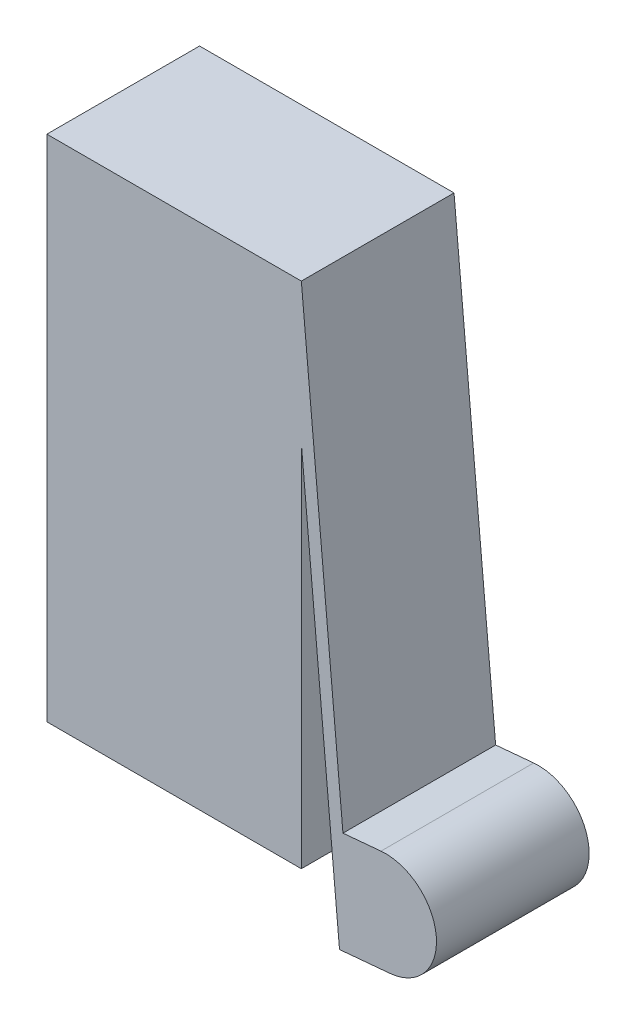
ISO-10303-21;
HEADER;
FILE_DESCRIPTION(('STEP AP214'),'2;1');
FILE_NAME('part.step','',(''),(''),'','','');
FILE_SCHEMA(('AUTOMOTIVE_DESIGN { 1 0 10303 214 1 1 1 1 }'));
ENDSEC;
DATA;
#1=APPLICATION_CONTEXT('core data for automotive mechanical design processes');
#2=APPLICATION_PROTOCOL_DEFINITION('international standard','automotive_design',2000,#1);
#3=PRODUCT_CONTEXT('',#1,'mechanical');
#4=PRODUCT('Part','Part','',(#3));
#5=PRODUCT_RELATED_PRODUCT_CATEGORY('part','',(#4));
#6=PRODUCT_DEFINITION_FORMATION('','',#4);
#7=PRODUCT_DEFINITION_CONTEXT('part definition',#1,'design');
#8=PRODUCT_DEFINITION('design','',#6,#7);
#9=PRODUCT_DEFINITION_SHAPE('','',#8);
#10=(LENGTH_UNIT() NAMED_UNIT(*) SI_UNIT(.MILLI.,.METRE.));
#11=(NAMED_UNIT(*) PLANE_ANGLE_UNIT() SI_UNIT($,.RADIAN.));
#12=(NAMED_UNIT(*) SI_UNIT($,.STERADIAN.) SOLID_ANGLE_UNIT());
#13=UNCERTAINTY_MEASURE_WITH_UNIT(LENGTH_MEASURE(1.E-05),#10,'distance_accuracy_value','');
#14=(GEOMETRIC_REPRESENTATION_CONTEXT(3) GLOBAL_UNCERTAINTY_ASSIGNED_CONTEXT((#13)) GLOBAL_UNIT_ASSIGNED_CONTEXT((#10,
#11,#12)) REPRESENTATION_CONTEXT('',''));
#15=CARTESIAN_POINT('',(0.,0.,0.));
#16=DIRECTION('',(0.,0.,1.));
#17=DIRECTION('',(1.,0.,0.));
#18=AXIS2_PLACEMENT_3D('',#15,#16,#17);
#19=CARTESIAN_POINT('',(10.,0.,6.));
#20=DIRECTION('',(1.,0.,0.));
#21=DIRECTION('',(0.,1.,0.));
#22=AXIS2_PLACEMENT_3D('',#19,#20,#21);
#23=PLANE('',#22);
#24=DIRECTION('',(0.,-1.,0.));
#25=VECTOR('',#24,1.);
#26=CARTESIAN_POINT('',(10.,0.,0.));
#27=LINE('',#26,#25);
#28=CARTESIAN_POINT('',(10.,14.4829721181068,0.));
#29=VERTEX_POINT('',#28);
#30=CARTESIAN_POINT('',(10.,0.,0.));
#31=VERTEX_POINT('',#30);
#32=EDGE_CURVE('E135',#29,#31,#27,.T.);
#33=ORIENTED_EDGE('',*,*,#32,.F.);
#34=DIRECTION('',(0.,0.,-1.));
#35=VECTOR('',#34,1.);
#36=CARTESIAN_POINT('',(10.,14.4829721181068,6.));
#37=LINE('',#36,#35);
#38=CARTESIAN_POINT('',(10.,14.4829721181068,6.));
#39=VERTEX_POINT('',#38);
#40=EDGE_CURVE('E11',#39,#29,#37,.T.);
#41=ORIENTED_EDGE('',*,*,#40,.F.);
#42=DIRECTION('',(0.,-1.,0.));
#43=VECTOR('',#42,1.);
#44=CARTESIAN_POINT('',(10.,0.,6.));
#45=LINE('',#44,#43);
#46=CARTESIAN_POINT('',(10.,0.,6.));
#47=VERTEX_POINT('',#46);
#48=EDGE_CURVE('E156',#39,#47,#45,.T.);
#49=ORIENTED_EDGE('',*,*,#48,.T.);
#50=DIRECTION('',(0.,0.,-1.));
#51=VECTOR('',#50,1.);
#52=CARTESIAN_POINT('',(10.,0.,6.));
#53=LINE('',#52,#51);
#54=EDGE_CURVE('E87',#47,#31,#53,.T.);
#55=ORIENTED_EDGE('',*,*,#54,.T.);
#56=EDGE_LOOP('',(#33,#41,#49,#55));
#57=FACE_BOUND('',#56,.T.);
#58=ADVANCED_FACE('F34',(#57),#23,.T.);
#59=CARTESIAN_POINT('',(11.2250333482068,1.02151176994432,6.));
#60=DIRECTION('',(0.995884769297829,0.0906285069975793,0.));
#61=DIRECTION('',(-0.0906285069975793,0.995884769297829,0.));
#62=AXIS2_PLACEMENT_3D('',#59,#60,#61);
#63=PLANE('',#62);
#64=DIRECTION('',(0.0906285069975793,-0.995884769297829,0.));
#65=VECTOR('',#64,1.);
#66=CARTESIAN_POINT('',(11.2250333482068,1.02151176994432,0.));
#67=LINE('',#66,#65);
#68=CARTESIAN_POINT('',(11.5,-2.,0.));
#69=VERTEX_POINT('',#68);
#70=EDGE_CURVE('E138',#29,#69,#67,.T.);
#71=ORIENTED_EDGE('',*,*,#70,.T.);
#72=DIRECTION('',(0.,0.,-1.));
#73=VECTOR('',#72,1.);
#74=CARTESIAN_POINT('',(11.5,-2.,6.));
#75=LINE('',#74,#73);
#76=CARTESIAN_POINT('',(11.5,-2.,6.));
#77=VERTEX_POINT('',#76);
#78=EDGE_CURVE('E42',#77,#69,#75,.T.);
#79=ORIENTED_EDGE('',*,*,#78,.F.);
#80=DIRECTION('',(0.0906285069975793,-0.995884769297829,0.));
#81=VECTOR('',#80,1.);
#82=CARTESIAN_POINT('',(11.2250333482068,1.02151176994432,6.));
#83=LINE('',#82,#81);
#84=EDGE_CURVE('E186',#39,#77,#83,.T.);
#85=ORIENTED_EDGE('',*,*,#84,.F.);
#86=ORIENTED_EDGE('',*,*,#40,.T.);
#87=EDGE_LOOP('',(#71,#79,#85,#86));
#88=FACE_BOUND('',#87,.T.);
#89=ADVANCED_FACE('F190',(#88),#63,.F.);
#90=CARTESIAN_POINT('',(0.274966651793202,-3.02151176994433,6.));
#91=DIRECTION('',(-0.0906285069975797,0.995884769297829,0.));
#92=DIRECTION('',(-0.995884769297829,-0.0906285069975797,0.));
#93=AXIS2_PLACEMENT_3D('',#90,#91,#92);
#94=PLANE('',#93);
#95=DIRECTION('',(0.995884769297829,0.0906285069975797,0.));
#96=VECTOR('',#95,1.);
#97=CARTESIAN_POINT('',(0.274966651793202,-3.02151176994433,0.));
#98=LINE('',#97,#96);
#99=CARTESIAN_POINT('',(13.4917695385957,-1.81874298600484,0.));
#100=VERTEX_POINT('',#99);
#101=EDGE_CURVE('E140',#69,#100,#98,.T.);
#102=ORIENTED_EDGE('',*,*,#101,.T.);
#103=DIRECTION('',(0.,0.,-1.));
#104=VECTOR('',#103,1.);
#105=CARTESIAN_POINT('',(13.4917695385957,-1.81874298600484,6.));
#106=LINE('',#105,#104);
#107=CARTESIAN_POINT('',(13.4917695385957,-1.81874298600484,6.));
#108=VERTEX_POINT('',#107);
#109=EDGE_CURVE('E164',#108,#100,#106,.T.);
#110=ORIENTED_EDGE('',*,*,#109,.F.);
#111=DIRECTION('',(0.995884769297829,0.0906285069975797,0.));
#112=VECTOR('',#111,1.);
#113=CARTESIAN_POINT('',(0.274966651793202,-3.02151176994433,6.));
#114=LINE('',#113,#112);
#115=EDGE_CURVE('E172',#77,#108,#114,.T.);
#116=ORIENTED_EDGE('',*,*,#115,.F.);
#117=ORIENTED_EDGE('',*,*,#78,.T.);
#118=EDGE_LOOP('',(#102,#110,#116,#117));
#119=FACE_BOUND('',#118,.T.);
#120=ADVANCED_FACE('F170',(#119),#94,.F.);
#121=CARTESIAN_POINT('',(13.3105125246005,0.173026552590817,6.));
#122=DIRECTION('',(0.,0.,-1.));
#123=DIRECTION('',(-1.,0.,0.));
#124=AXIS2_PLACEMENT_3D('',#121,#122,#123);
#125=CYLINDRICAL_SURFACE('',#124,2.);
#126=CARTESIAN_POINT('',(13.3105125246005,0.173026552590817,0.));
#127=DIRECTION('',(0.,0.,1.));
#128=DIRECTION('',(1.,0.,0.));
#129=AXIS2_PLACEMENT_3D('',#126,#127,#128);
#130=CIRCLE('',#129,2.);
#131=CARTESIAN_POINT('',(13.1292555106053,2.16479609118647,0.));
#132=VERTEX_POINT('',#131);
#133=EDGE_CURVE('E143',#132,#100,#130,.F.);
#134=ORIENTED_EDGE('',*,*,#133,.F.);
#135=DIRECTION('',(0.,0.,-1.));
#136=VECTOR('',#135,1.);
#137=CARTESIAN_POINT('',(13.1292555106053,2.16479609118647,6.));
#138=LINE('',#137,#136);
#139=CARTESIAN_POINT('',(13.1292555106053,2.16479609118647,6.));
#140=VERTEX_POINT('',#139);
#141=EDGE_CURVE('E162',#140,#132,#138,.T.);
#142=ORIENTED_EDGE('',*,*,#141,.F.);
#143=CARTESIAN_POINT('',(13.3105125246005,0.173026552590817,6.));
#144=DIRECTION('',(0.,0.,1.));
#145=DIRECTION('',(1.,0.,0.));
#146=AXIS2_PLACEMENT_3D('',#143,#144,#145);
#147=CIRCLE('',#146,2.);
#148=EDGE_CURVE('E183',#140,#108,#147,.F.);
#149=ORIENTED_EDGE('',*,*,#148,.T.);
#150=ORIENTED_EDGE('',*,*,#109,.T.);
#151=EDGE_LOOP('',(#134,#142,#149,#150));
#152=FACE_BOUND('',#151,.T.);
#153=ADVANCED_FACE('F180',(#152),#125,.T.);
#154=CARTESIAN_POINT('',(-0.0875473761971172,0.96202730724699,6.));
#155=DIRECTION('',(-0.0906285069975793,0.995884769297829,0.));
#156=DIRECTION('',(-0.995884769297829,-0.0906285069975793,0.));
#157=AXIS2_PLACEMENT_3D('',#154,#155,#156);
#158=PLANE('',#157);
#159=DIRECTION('',(0.995884769297829,0.0906285069975793,0.));
#160=VECTOR('',#159,1.);
#161=CARTESIAN_POINT('',(-0.0875473761971172,0.96202730724699,0.));
#162=LINE('',#161,#160);
#163=CARTESIAN_POINT('',(11.6354283566586,2.02885333069011,0.));
#164=VERTEX_POINT('',#163);
#165=EDGE_CURVE('E146',#164,#132,#162,.T.);
#166=ORIENTED_EDGE('',*,*,#165,.F.);
#167=DIRECTION('',(0.,0.,-1.));
#168=VECTOR('',#167,1.);
#169=CARTESIAN_POINT('',(11.6354283566586,2.02885333069011,6.));
#170=LINE('',#169,#168);
#171=CARTESIAN_POINT('',(11.6354283566586,2.02885333069011,6.));
#172=VERTEX_POINT('',#171);
#173=EDGE_CURVE('E160',#172,#164,#170,.T.);
#174=ORIENTED_EDGE('',*,*,#173,.F.);
#175=DIRECTION('',(0.995884769297829,0.0906285069975793,0.));
#176=VECTOR('',#175,1.);
#177=CARTESIAN_POINT('',(-0.0875473761971172,0.96202730724699,6.));
#178=LINE('',#177,#176);
#179=EDGE_CURVE('E130',#172,#140,#178,.T.);
#180=ORIENTED_EDGE('',*,*,#179,.T.);
#181=ORIENTED_EDGE('',*,*,#141,.T.);
#182=EDGE_LOOP('',(#166,#174,#180,#181));
#183=FACE_BOUND('',#182,.T.);
#184=ADVANCED_FACE('F200',(#183),#158,.T.);
#185=CARTESIAN_POINT('',(11.7229757328557,1.06682602344312,6.));
#186=DIRECTION('',(0.995884769297829,0.0906285069975793,0.));
#187=DIRECTION('',(-0.0906285069975793,0.995884769297829,0.));
#188=AXIS2_PLACEMENT_3D('',#185,#186,#187);
#189=PLANE('',#188);
#190=DIRECTION('',(0.0906285069975793,-0.995884769297829,0.));
#191=VECTOR('',#190,1.);
#192=CARTESIAN_POINT('',(11.7229757328557,1.06682602344312,0.));
#193=LINE('',#192,#191);
#194=CARTESIAN_POINT('',(10.,20.,0.));
#195=VERTEX_POINT('',#194);
#196=EDGE_CURVE('E149',#195,#164,#193,.T.);
#197=ORIENTED_EDGE('',*,*,#196,.F.);
#198=DIRECTION('',(0.,0.,-1.));
#199=VECTOR('',#198,1.);
#200=CARTESIAN_POINT('',(10.,20.,6.));
#201=LINE('',#200,#199);
#202=CARTESIAN_POINT('',(10.,20.,6.));
#203=VERTEX_POINT('',#202);
#204=EDGE_CURVE('E118',#203,#195,#201,.T.);
#205=ORIENTED_EDGE('',*,*,#204,.F.);
#206=DIRECTION('',(0.0906285069975793,-0.995884769297829,0.));
#207=VECTOR('',#206,1.);
#208=CARTESIAN_POINT('',(11.7229757328557,1.06682602344312,6.));
#209=LINE('',#208,#207);
#210=EDGE_CURVE('E128',#203,#172,#209,.T.);
#211=ORIENTED_EDGE('',*,*,#210,.T.);
#212=ORIENTED_EDGE('',*,*,#173,.T.);
#213=EDGE_LOOP('',(#197,#205,#211,#212));
#214=FACE_BOUND('',#213,.T.);
#215=ADVANCED_FACE('F203',(#214),#189,.T.);
#216=CARTESIAN_POINT('',(0.,20.,6.));
#217=DIRECTION('',(0.,1.,0.));
#218=DIRECTION('',(0.,0.,1.));
#219=AXIS2_PLACEMENT_3D('',#216,#217,#218);
#220=PLANE('',#219);
#221=DIRECTION('',(1.,0.,0.));
#222=VECTOR('',#221,1.);
#223=CARTESIAN_POINT('',(0.,20.,0.));
#224=LINE('',#223,#222);
#225=CARTESIAN_POINT('',(0.,20.,0.));
#226=VERTEX_POINT('',#225);
#227=EDGE_CURVE('E117',#226,#195,#224,.T.);
#228=ORIENTED_EDGE('',*,*,#227,.F.);
#229=DIRECTION('',(0.,0.,-1.));
#230=VECTOR('',#229,1.);
#231=CARTESIAN_POINT('',(0.,20.,6.));
#232=LINE('',#231,#230);
#233=CARTESIAN_POINT('',(0.,20.,6.));
#234=VERTEX_POINT('',#233);
#235=EDGE_CURVE('E111',#234,#226,#232,.T.);
#236=ORIENTED_EDGE('',*,*,#235,.F.);
#237=DIRECTION('',(1.,0.,0.));
#238=VECTOR('',#237,1.);
#239=CARTESIAN_POINT('',(0.,20.,6.));
#240=LINE('',#239,#238);
#241=EDGE_CURVE('E115',#234,#203,#240,.T.);
#242=ORIENTED_EDGE('',*,*,#241,.T.);
#243=ORIENTED_EDGE('',*,*,#204,.T.);
#244=EDGE_LOOP('',(#228,#236,#242,#243));
#245=FACE_BOUND('',#244,.T.);
#246=ADVANCED_FACE('F113',(#245),#220,.T.);
#247=CARTESIAN_POINT('',(0.,0.,6.));
#248=DIRECTION('',(1.,0.,0.));
#249=DIRECTION('',(0.,1.,0.));
#250=AXIS2_PLACEMENT_3D('',#247,#248,#249);
#251=PLANE('',#250);
#252=DIRECTION('',(0.,-1.,0.));
#253=VECTOR('',#252,1.);
#254=CARTESIAN_POINT('',(0.,0.,0.));
#255=LINE('',#254,#253);
#256=CARTESIAN_POINT('',(0.,0.,0.));
#257=VERTEX_POINT('',#256);
#258=EDGE_CURVE('E80',#226,#257,#255,.T.);
#259=ORIENTED_EDGE('',*,*,#258,.T.);
#260=DIRECTION('',(0.,0.,-1.));
#261=VECTOR('',#260,1.);
#262=CARTESIAN_POINT('',(0.,0.,6.));
#263=LINE('',#262,#261);
#264=CARTESIAN_POINT('',(0.,0.,6.));
#265=VERTEX_POINT('',#264);
#266=EDGE_CURVE('E119',#265,#257,#263,.T.);
#267=ORIENTED_EDGE('',*,*,#266,.F.);
#268=DIRECTION('',(0.,-1.,0.));
#269=VECTOR('',#268,1.);
#270=CARTESIAN_POINT('',(0.,0.,6.));
#271=LINE('',#270,#269);
#272=EDGE_CURVE('E121',#234,#265,#271,.T.);
#273=ORIENTED_EDGE('',*,*,#272,.F.);
#274=ORIENTED_EDGE('',*,*,#235,.T.);
#275=EDGE_LOOP('',(#259,#267,#273,#274));
#276=FACE_BOUND('',#275,.T.);
#277=ADVANCED_FACE('F122',(#276),#251,.F.);
#278=CARTESIAN_POINT('',(0.,0.,6.));
#279=DIRECTION('',(0.,1.,0.));
#280=DIRECTION('',(0.,0.,1.));
#281=AXIS2_PLACEMENT_3D('',#278,#279,#280);
#282=PLANE('',#281);
#283=DIRECTION('',(1.,0.,0.));
#284=VECTOR('',#283,1.);
#285=CARTESIAN_POINT('',(0.,0.,0.));
#286=LINE('',#285,#284);
#287=EDGE_CURVE('E154',#257,#31,#286,.T.);
#288=ORIENTED_EDGE('',*,*,#287,.T.);
#289=ORIENTED_EDGE('',*,*,#54,.F.);
#290=DIRECTION('',(1.,0.,0.));
#291=VECTOR('',#290,1.);
#292=CARTESIAN_POINT('',(0.,0.,6.));
#293=LINE('',#292,#291);
#294=EDGE_CURVE('E50',#265,#47,#293,.T.);
#295=ORIENTED_EDGE('',*,*,#294,.F.);
#296=ORIENTED_EDGE('',*,*,#266,.T.);
#297=EDGE_LOOP('',(#288,#289,#295,#296));
#298=FACE_BOUND('',#297,.T.);
#299=ADVANCED_FACE('F212',(#298),#282,.F.);
#300=CARTESIAN_POINT('',(0.,0.,6.));
#301=DIRECTION('',(0.,0.,1.));
#302=DIRECTION('',(1.,0.,0.));
#303=AXIS2_PLACEMENT_3D('',#300,#301,#302);
#304=PLANE('',#303);
#305=ORIENTED_EDGE('',*,*,#48,.F.);
#306=ORIENTED_EDGE('',*,*,#84,.T.);
#307=ORIENTED_EDGE('',*,*,#115,.T.);
#308=ORIENTED_EDGE('',*,*,#148,.F.);
#309=ORIENTED_EDGE('',*,*,#179,.F.);
#310=ORIENTED_EDGE('',*,*,#210,.F.);
#311=ORIENTED_EDGE('',*,*,#241,.F.);
#312=ORIENTED_EDGE('',*,*,#272,.T.);
#313=ORIENTED_EDGE('',*,*,#294,.T.);
#314=EDGE_LOOP('',(#305,#306,#307,#308,#309,#310,#311,#312,#313));
#315=FACE_BOUND('',#314,.T.);
#316=ADVANCED_FACE('F125',(#315),#304,.T.);
#317=CARTESIAN_POINT('',(0.,0.,0.));
#318=DIRECTION('',(0.,0.,1.));
#319=DIRECTION('',(1.,0.,0.));
#320=AXIS2_PLACEMENT_3D('',#317,#318,#319);
#321=PLANE('',#320);
#322=ORIENTED_EDGE('',*,*,#32,.T.);
#323=ORIENTED_EDGE('',*,*,#287,.F.);
#324=ORIENTED_EDGE('',*,*,#258,.F.);
#325=ORIENTED_EDGE('',*,*,#227,.T.);
#326=ORIENTED_EDGE('',*,*,#196,.T.);
#327=ORIENTED_EDGE('',*,*,#165,.T.);
#328=ORIENTED_EDGE('',*,*,#133,.T.);
#329=ORIENTED_EDGE('',*,*,#101,.F.);
#330=ORIENTED_EDGE('',*,*,#70,.F.);
#331=EDGE_LOOP('',(#322,#323,#324,#325,#326,#327,#328,#329,#330));
#332=FACE_BOUND('',#331,.T.);
#333=ADVANCED_FACE('F176',(#332),#321,.F.);
#334=CLOSED_SHELL('',(#58,#89,#120,#153,#184,#215,#246,#277,#299,#316,#333));
#335=MANIFOLD_SOLID_BREP('B2',#334);
#336=ADVANCED_BREP_SHAPE_REPRESENTATION('',(#18,#335),#14);
#337=SHAPE_DEFINITION_REPRESENTATION(#9,#336);
ENDSEC;
END-ISO-10303-21;
